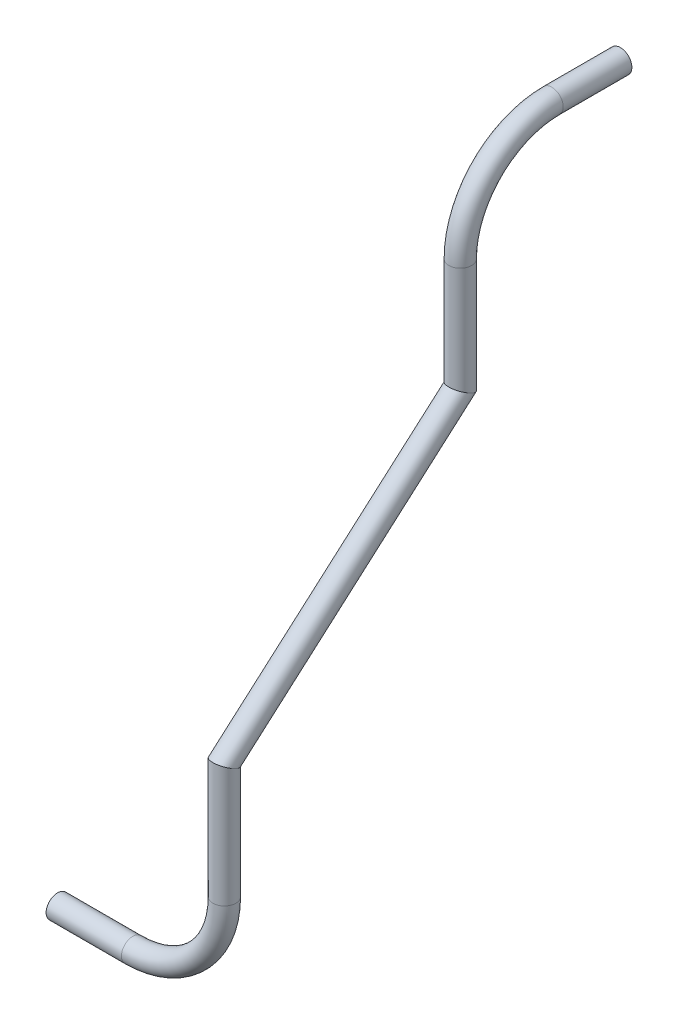
ISO-10303-21;
HEADER;
FILE_DESCRIPTION(('STEP AP214'),'2;1');
FILE_NAME('part.step','',(''),(''),'','','');
FILE_SCHEMA(('AUTOMOTIVE_DESIGN { 1 0 10303 214 1 1 1 1 }'));
ENDSEC;
DATA;
#1=APPLICATION_CONTEXT('core data for automotive mechanical design processes');
#2=APPLICATION_PROTOCOL_DEFINITION('international standard','automotive_design',2000,#1);
#3=PRODUCT_CONTEXT('',#1,'mechanical');
#4=PRODUCT('Part','Part','',(#3));
#5=PRODUCT_RELATED_PRODUCT_CATEGORY('part','',(#4));
#6=PRODUCT_DEFINITION_FORMATION('','',#4);
#7=PRODUCT_DEFINITION_CONTEXT('part definition',#1,'design');
#8=PRODUCT_DEFINITION('design','',#6,#7);
#9=PRODUCT_DEFINITION_SHAPE('','',#8);
#10=(LENGTH_UNIT() NAMED_UNIT(*) SI_UNIT(.MILLI.,.METRE.));
#11=(NAMED_UNIT(*) PLANE_ANGLE_UNIT() SI_UNIT($,.RADIAN.));
#12=(NAMED_UNIT(*) SI_UNIT($,.STERADIAN.) SOLID_ANGLE_UNIT());
#13=UNCERTAINTY_MEASURE_WITH_UNIT(LENGTH_MEASURE(1.E-05),#10,'distance_accuracy_value','');
#14=(GEOMETRIC_REPRESENTATION_CONTEXT(3) GLOBAL_UNCERTAINTY_ASSIGNED_CONTEXT((#13)) GLOBAL_UNIT_ASSIGNED_CONTEXT((#10,
#11,#12)) REPRESENTATION_CONTEXT('',''));
#15=CARTESIAN_POINT('',(0.,0.,0.));
#16=DIRECTION('',(0.,0.,1.));
#17=DIRECTION('',(1.,0.,0.));
#18=AXIS2_PLACEMENT_3D('',#15,#16,#17);
#19=CARTESIAN_POINT('',(-360.990564543855,1382.24393798514,528.675597350539));
#20=DIRECTION('',(-1.,0.,0.));
#21=DIRECTION('',(0.,0.,1.));
#22=AXIS2_PLACEMENT_3D('',#19,#20,#21);
#23=CYLINDRICAL_SURFACE('',#22,5.28320000000001);
#24=CARTESIAN_POINT('',(-402.785662914569,1382.24393798514,528.675597350539));
#25=DIRECTION('',(1.,0.,0.));
#26=DIRECTION('',(0.,0.,-1.));
#27=AXIS2_PLACEMENT_3D('',#24,#25,#26);
#28=CIRCLE('',#27,5.28320000000001);
#29=CARTESIAN_POINT('',(-402.785662914569,1382.24393798514,523.392397350539));
#30=VERTEX_POINT('',#29);
#31=EDGE_CURVE('E56',#30,#30,#28,.T.);
#32=ORIENTED_EDGE('',*,*,#31,.F.);
#33=EDGE_LOOP('',(#32));
#34=FACE_BOUND('',#33,.T.);
#35=CARTESIAN_POINT('',(-360.990564543855,1382.24393798514,528.675597350539));
#36=DIRECTION('',(1.,0.,0.));
#37=DIRECTION('',(0.,0.,-1.));
#38=AXIS2_PLACEMENT_3D('',#35,#36,#37);
#39=CIRCLE('',#38,5.28320000000001);
#40=CARTESIAN_POINT('',(-360.990564543855,1382.24393798514,523.392397350539));
#41=VERTEX_POINT('',#40);
#42=EDGE_CURVE('E52',#41,#41,#39,.T.);
#43=ORIENTED_EDGE('',*,*,#42,.T.);
#44=EDGE_LOOP('',(#43));
#45=FACE_BOUND('',#44,.T.);
#46=ADVANCED_FACE('F48',(#34,#45),#23,.F.);
#47=CARTESIAN_POINT('',(-360.990564543855,1382.24393798514,528.675597350539));
#48=DIRECTION('',(-1.,0.,0.));
#49=DIRECTION('',(0.,0.,1.));
#50=AXIS2_PLACEMENT_3D('',#47,#48,#49);
#51=CYLINDRICAL_SURFACE('',#50,6.35000000000005);
#52=CARTESIAN_POINT('',(-402.785662914569,1382.24393798514,528.675597350539));
#53=DIRECTION('',(1.,0.,0.));
#54=DIRECTION('',(0.,0.,-1.));
#55=AXIS2_PLACEMENT_3D('',#52,#53,#54);
#56=CIRCLE('',#55,6.35000000000005);
#57=CARTESIAN_POINT('',(-402.785662914569,1382.24393798514,522.325597350539));
#58=VERTEX_POINT('',#57);
#59=EDGE_CURVE('E60',#58,#58,#56,.T.);
#60=ORIENTED_EDGE('',*,*,#59,.T.);
#61=EDGE_LOOP('',(#60));
#62=FACE_BOUND('',#61,.T.);
#63=CARTESIAN_POINT('',(-360.990564543855,1382.24393798514,528.675597350539));
#64=DIRECTION('',(1.,0.,0.));
#65=DIRECTION('',(0.,0.,-1.));
#66=AXIS2_PLACEMENT_3D('',#63,#64,#65);
#67=CIRCLE('',#66,6.35000000000005);
#68=CARTESIAN_POINT('',(-360.990564543855,1382.24393798514,522.325597350539));
#69=VERTEX_POINT('',#68);
#70=EDGE_CURVE('E12',#69,#69,#67,.T.);
#71=ORIENTED_EDGE('',*,*,#70,.F.);
#72=EDGE_LOOP('',(#71));
#73=FACE_BOUND('',#72,.T.);
#74=ADVANCED_FACE('F75',(#62,#73),#51,.T.);
#75=CARTESIAN_POINT('',(-402.785662914569,1382.24393798514,528.675597350539));
#76=DIRECTION('',(1.,0.,0.));
#77=DIRECTION('',(0.,0.,-1.));
#78=AXIS2_PLACEMENT_3D('',#75,#76,#77);
#79=PLANE('',#78);
#80=ORIENTED_EDGE('',*,*,#31,.T.);
#81=EDGE_LOOP('',(#80));
#82=FACE_BOUND('',#81,.T.);
#83=ORIENTED_EDGE('',*,*,#59,.F.);
#84=EDGE_LOOP('',(#83));
#85=FACE_BOUND('',#84,.T.);
#86=ADVANCED_FACE('F71',(#82,#85),#79,.F.);
#87=CARTESIAN_POINT('',(-360.990564543855,1382.24393798514,528.675597350539));
#88=DIRECTION('',(1.,0.,0.));
#89=DIRECTION('',(0.,0.,-1.));
#90=AXIS2_PLACEMENT_3D('',#87,#88,#89);
#91=PLANE('',#90);
#92=ORIENTED_EDGE('',*,*,#42,.F.);
#93=EDGE_LOOP('',(#92));
#94=FACE_BOUND('',#93,.T.);
#95=ORIENTED_EDGE('',*,*,#70,.T.);
#96=EDGE_LOOP('',(#95));
#97=FACE_BOUND('',#96,.T.);
#98=ADVANCED_FACE('F50',(#94,#97),#91,.T.);
#99=CLOSED_SHELL('',(#46,#74,#86,#98));
#100=MANIFOLD_SOLID_BREP('B2',#99);
#101=CARTESIAN_POINT('',(-360.990564543855,1433.04393798514,528.675597350539));
#102=DIRECTION('',(0.,0.,-1.));
#103=DIRECTION('',(-1.,0.,0.));
#104=AXIS2_PLACEMENT_3D('',#101,#102,#103);
#105=TOROIDAL_SURFACE('',#104,50.8,5.28320000000001);
#106=CARTESIAN_POINT('',(-310.190564543855,1433.04393798514,528.675597350539));
#107=DIRECTION('',(0.,1.,0.));
#108=DIRECTION('',(-1.,0.,0.));
#109=AXIS2_PLACEMENT_3D('',#106,#107,#108);
#110=CIRCLE('',#109,5.28320000000001);
#111=CARTESIAN_POINT('',(-304.907364543855,1433.04393798514,528.675597350539));
#112=VERTEX_POINT('',#111);
#113=EDGE_CURVE('E152',#112,#112,#110,.T.);
#114=CARTESIAN_POINT('',(-360.990564543855,1382.24393798514,528.675597350539));
#115=DIRECTION('',(-1.,0.,0.));
#116=DIRECTION('',(0.,0.,1.));
#117=AXIS2_PLACEMENT_3D('',#114,#115,#116);
#118=CIRCLE('',#117,5.28320000000001);
#119=CARTESIAN_POINT('',(-360.990564543855,1376.96073798514,528.675597350539));
#120=VERTEX_POINT('',#119);
#121=EDGE_CURVE('E142',#120,#120,#118,.T.);
#122=CARTESIAN_POINT('',(-360.990564543855,1433.04393798514,528.675597350539));
#123=DIRECTION('',(0.,0.,-1.));
#124=DIRECTION('',(-1.,0.,0.));
#125=AXIS2_PLACEMENT_3D('',#122,#123,#124);
#126=CIRCLE('',#125,56.0832);
#127=EDGE_CURVE('',#112,#120,#126,.T.);
#128=ORIENTED_EDGE('',*,*,#113,.T.);
#129=ORIENTED_EDGE('',*,*,#121,.T.);
#130=ORIENTED_EDGE('',*,*,#127,.T.);
#131=ORIENTED_EDGE('',*,*,#127,.F.);
#132=EDGE_LOOP('',(#128,#130,#129,#131));
#133=FACE_BOUND('',#132,.T.);
#134=ADVANCED_FACE('F138',(#133),#105,.F.);
#135=CARTESIAN_POINT('',(-360.990564543855,1433.04393798514,528.675597350539));
#136=DIRECTION('',(0.,0.,-1.));
#137=DIRECTION('',(-1.,0.,0.));
#138=AXIS2_PLACEMENT_3D('',#135,#136,#137);
#139=TOROIDAL_SURFACE('',#138,50.8,6.35000000000005);
#140=CARTESIAN_POINT('',(-310.190564543855,1433.04393798514,528.675597350539));
#141=DIRECTION('',(0.,1.,0.));
#142=DIRECTION('',(-1.,0.,0.));
#143=AXIS2_PLACEMENT_3D('',#140,#141,#142);
#144=CIRCLE('',#143,6.35000000000005);
#145=CARTESIAN_POINT('',(-303.840564543855,1433.04393798514,528.675597350539));
#146=VERTEX_POINT('',#145);
#147=EDGE_CURVE('E146',#146,#146,#144,.T.);
#148=CARTESIAN_POINT('',(-360.990564543855,1382.24393798514,528.675597350539));
#149=DIRECTION('',(-1.,0.,0.));
#150=DIRECTION('',(0.,0.,1.));
#151=AXIS2_PLACEMENT_3D('',#148,#149,#150);
#152=CIRCLE('',#151,6.35000000000005);
#153=CARTESIAN_POINT('',(-360.990564543855,1375.89393798514,528.675597350539));
#154=VERTEX_POINT('',#153);
#155=EDGE_CURVE('E47',#154,#154,#152,.T.);
#156=CARTESIAN_POINT('',(-360.990564543855,1433.04393798514,528.675597350539));
#157=DIRECTION('',(0.,0.,-1.));
#158=DIRECTION('',(-1.,0.,0.));
#159=AXIS2_PLACEMENT_3D('',#156,#157,#158);
#160=CIRCLE('',#159,57.1500000000001);
#161=EDGE_CURVE('',#146,#154,#160,.T.);
#162=ORIENTED_EDGE('',*,*,#147,.F.);
#163=ORIENTED_EDGE('',*,*,#155,.F.);
#164=ORIENTED_EDGE('',*,*,#161,.T.);
#165=ORIENTED_EDGE('',*,*,#161,.F.);
#166=EDGE_LOOP('',(#162,#164,#163,#165));
#167=FACE_BOUND('',#166,.T.);
#168=ADVANCED_FACE('F165',(#167),#139,.T.);
#169=CARTESIAN_POINT('',(-310.190564543855,1433.04393798514,528.675597350539));
#170=DIRECTION('',(0.,1.,0.));
#171=DIRECTION('',(-1.,0.,0.));
#172=AXIS2_PLACEMENT_3D('',#169,#170,#171);
#173=PLANE('',#172);
#174=ORIENTED_EDGE('',*,*,#113,.F.);
#175=EDGE_LOOP('',(#174));
#176=FACE_BOUND('',#175,.T.);
#177=ORIENTED_EDGE('',*,*,#147,.T.);
#178=EDGE_LOOP('',(#177));
#179=FACE_BOUND('',#178,.T.);
#180=ADVANCED_FACE('F161',(#176,#179),#173,.T.);
#181=CARTESIAN_POINT('',(-360.990564543855,1382.24393798514,528.675597350539));
#182=DIRECTION('',(-1.,0.,0.));
#183=DIRECTION('',(0.,0.,1.));
#184=AXIS2_PLACEMENT_3D('',#181,#182,#183);
#185=PLANE('',#184);
#186=ORIENTED_EDGE('',*,*,#121,.F.);
#187=EDGE_LOOP('',(#186));
#188=FACE_BOUND('',#187,.T.);
#189=ORIENTED_EDGE('',*,*,#155,.T.);
#190=EDGE_LOOP('',(#189));
#191=FACE_BOUND('',#190,.T.);
#192=ADVANCED_FACE('F140',(#188,#191),#185,.T.);
#193=CLOSED_SHELL('',(#134,#168,#180,#192));
#194=MANIFOLD_SOLID_BREP('B7',#193);
#195=CARTESIAN_POINT('',(-310.190564543855,1497.77881638538,528.675597350539));
#196=DIRECTION('',(0.,-1.,0.));
#197=DIRECTION('',(0.,0.,-1.));
#198=AXIS2_PLACEMENT_3D('',#195,#196,#197);
#199=CYLINDRICAL_SURFACE('',#198,5.28320000000001);
#200=CARTESIAN_POINT('',(-310.190564543855,1497.77881638538,528.675597350539));
#201=DIRECTION('',(-3.30073379565397E-05,0.911047269287223,-0.412301918543693));
#202=DIRECTION('',(-7.29350111238835E-05,-0.412301919864914,-0.911047266367772));
#203=AXIS2_PLACEMENT_3D('',#200,#201,#202);
#204=ELLIPSE('',#203,5.79904048681627,5.28320000000001);
#205=CARTESIAN_POINT('',(-310.190987496937,1495.38786085929,523.392397367469));
#206=VERTEX_POINT('',#205);
#207=EDGE_CURVE('E246',#206,#206,#204,.T.);
#208=ORIENTED_EDGE('',*,*,#207,.T.);
#209=EDGE_LOOP('',(#208));
#210=FACE_BOUND('',#209,.T.);
#211=CARTESIAN_POINT('',(-310.190564543855,1433.04393798514,528.675597350539));
#212=DIRECTION('',(0.,-1.,0.));
#213=DIRECTION('',(1.,0.,0.));
#214=AXIS2_PLACEMENT_3D('',#211,#212,#213);
#215=CIRCLE('',#214,5.28320000000001);
#216=CARTESIAN_POINT('',(-304.907364543855,1433.04393798514,528.675597350539));
#217=VERTEX_POINT('',#216);
#218=EDGE_CURVE('E236',#217,#217,#215,.T.);
#219=ORIENTED_EDGE('',*,*,#218,.T.);
#220=EDGE_LOOP('',(#219));
#221=FACE_BOUND('',#220,.T.);
#222=ADVANCED_FACE('F232',(#210,#221),#199,.F.);
#223=CARTESIAN_POINT('',(-310.190564543855,1497.77881638538,528.675597350539));
#224=DIRECTION('',(0.,-1.,0.));
#225=DIRECTION('',(0.,0.,-1.));
#226=AXIS2_PLACEMENT_3D('',#223,#224,#225);
#227=CYLINDRICAL_SURFACE('',#226,6.35000000000005);
#228=CARTESIAN_POINT('',(-310.190564543855,1497.77881638538,528.675597350539));
#229=DIRECTION('',(-3.30073379565397E-05,0.911047269287223,-0.412301918543693));
#230=DIRECTION('',(-7.29350111238835E-05,-0.412301919864914,-0.911047266367772));
#231=AXIS2_PLACEMENT_3D('',#228,#229,#230);
#232=ELLIPSE('',#231,6.97000058511574,6.35000000000005);
#233=CARTESIAN_POINT('',(-310.191072900925,1494.90507176267,522.325597370887));
#234=VERTEX_POINT('',#233);
#235=EDGE_CURVE('E240',#234,#234,#232,.T.);
#236=ORIENTED_EDGE('',*,*,#235,.F.);
#237=EDGE_LOOP('',(#236));
#238=FACE_BOUND('',#237,.T.);
#239=CARTESIAN_POINT('',(-310.190564543855,1433.04393798514,528.675597350539));
#240=DIRECTION('',(0.,-1.,0.));
#241=DIRECTION('',(1.,0.,0.));
#242=AXIS2_PLACEMENT_3D('',#239,#240,#241);
#243=CIRCLE('',#242,6.35000000000005);
#244=CARTESIAN_POINT('',(-303.840564543855,1433.04393798514,528.675597350539));
#245=VERTEX_POINT('',#244);
#246=EDGE_CURVE('E137',#245,#245,#243,.T.);
#247=ORIENTED_EDGE('',*,*,#246,.F.);
#248=EDGE_LOOP('',(#247));
#249=FACE_BOUND('',#248,.T.);
#250=ADVANCED_FACE('F259',(#238,#249),#227,.T.);
#251=CARTESIAN_POINT('',(-310.190564543855,1497.77881638538,528.675597350539));
#252=DIRECTION('',(-3.30073379565397E-05,0.911047269287223,-0.412301918543693));
#253=DIRECTION('',(0.,0.412301918768291,0.911047269783509));
#254=AXIS2_PLACEMENT_3D('',#251,#252,#253);
#255=PLANE('',#254);
#256=ORIENTED_EDGE('',*,*,#207,.F.);
#257=EDGE_LOOP('',(#256));
#258=FACE_BOUND('',#257,.T.);
#259=ORIENTED_EDGE('',*,*,#235,.T.);
#260=EDGE_LOOP('',(#259));
#261=FACE_BOUND('',#260,.T.);
#262=ADVANCED_FACE('F255',(#258,#261),#255,.T.);
#263=CARTESIAN_POINT('',(-310.190564543855,1433.04393798514,528.675597350539));
#264=DIRECTION('',(0.,-1.,0.));
#265=DIRECTION('',(1.,0.,0.));
#266=AXIS2_PLACEMENT_3D('',#263,#264,#265);
#267=PLANE('',#266);
#268=ORIENTED_EDGE('',*,*,#218,.F.);
#269=EDGE_LOOP('',(#268));
#270=FACE_BOUND('',#269,.T.);
#271=ORIENTED_EDGE('',*,*,#246,.T.);
#272=EDGE_LOOP('',(#271));
#273=FACE_BOUND('',#272,.T.);
#274=ADVANCED_FACE('F234',(#270,#273),#267,.T.);
#275=CLOSED_SHELL('',(#222,#250,#262,#274));
#276=MANIFOLD_SOLID_BREP('B42',#275);
#277=CARTESIAN_POINT('',(-310.201049776566,1612.84560223325,397.702249283075));
#278=DIRECTION('',(6.01424902236145E-05,-0.660014253751412,0.751253074022228));
#279=DIRECTION('',(0.,-0.751253075380914,-0.660014254945087));
#280=AXIS2_PLACEMENT_3D('',#277,#278,#279);
#281=CYLINDRICAL_SURFACE('',#280,5.28320000000001);
#282=CARTESIAN_POINT('',(-310.201049776566,1612.84560223325,397.702249283075));
#283=DIRECTION('',(-3.30073379565397E-05,0.911047269287223,-0.412301918543692));
#284=DIRECTION('',(7.29350111241805E-05,0.412301919864913,0.911047266367772));
#285=AXIS2_PLACEMENT_3D('',#282,#283,#284);
#286=ELLIPSE('',#285,5.79904048681627,5.28320000000001);
#287=CARTESIAN_POINT('',(-310.200626823483,1615.23655775934,402.985449266145));
#288=VERTEX_POINT('',#287);
#289=EDGE_CURVE('E338',#288,#288,#286,.T.);
#290=ORIENTED_EDGE('',*,*,#289,.T.);
#291=EDGE_LOOP('',(#290));
#292=FACE_BOUND('',#291,.T.);
#293=CARTESIAN_POINT('',(-310.190564543855,1497.77881638538,528.675597350539));
#294=DIRECTION('',(3.30073379565398E-05,-0.911047269287223,0.412301918543693));
#295=DIRECTION('',(7.29350111241805E-05,0.412301919864914,0.911047266367772));
#296=AXIS2_PLACEMENT_3D('',#293,#294,#295);
#297=ELLIPSE('',#296,5.79904048681627,5.28320000000001);
#298=CARTESIAN_POINT('',(-310.190141590773,1500.16977191146,533.958797333609));
#299=VERTEX_POINT('',#298);
#300=EDGE_CURVE('E328',#299,#299,#297,.T.);
#301=ORIENTED_EDGE('',*,*,#300,.T.);
#302=EDGE_LOOP('',(#301));
#303=FACE_BOUND('',#302,.T.);
#304=ADVANCED_FACE('F324',(#292,#303),#281,.F.);
#305=CARTESIAN_POINT('',(-310.201049776566,1612.84560223325,397.702249283075));
#306=DIRECTION('',(6.01424902236145E-05,-0.660014253751412,0.751253074022228));
#307=DIRECTION('',(0.,-0.751253075380914,-0.660014254945087));
#308=AXIS2_PLACEMENT_3D('',#305,#306,#307);
#309=CYLINDRICAL_SURFACE('',#308,6.35000000000005);
#310=CARTESIAN_POINT('',(-310.201049776566,1612.84560223325,397.702249283075));
#311=DIRECTION('',(-3.30073379565397E-05,0.911047269287223,-0.412301918543692));
#312=DIRECTION('',(7.29350111241805E-05,0.412301919864913,0.911047266367772));
#313=AXIS2_PLACEMENT_3D('',#310,#311,#312);
#314=ELLIPSE('',#313,6.97000058511575,6.35000000000005);
#315=CARTESIAN_POINT('',(-310.200541419495,1615.71934685595,404.052249262726));
#316=VERTEX_POINT('',#315);
#317=EDGE_CURVE('E332',#316,#316,#314,.T.);
#318=ORIENTED_EDGE('',*,*,#317,.F.);
#319=EDGE_LOOP('',(#318));
#320=FACE_BOUND('',#319,.T.);
#321=CARTESIAN_POINT('',(-310.190564543855,1497.77881638538,528.675597350539));
#322=DIRECTION('',(3.30073379565398E-05,-0.911047269287223,0.412301918543693));
#323=DIRECTION('',(7.29350111241805E-05,0.412301919864914,0.911047266367772));
#324=AXIS2_PLACEMENT_3D('',#321,#322,#323);
#325=ELLIPSE('',#324,6.97000058511575,6.35000000000005);
#326=CARTESIAN_POINT('',(-310.190056186785,1500.65256100808,535.02559733019));
#327=VERTEX_POINT('',#326);
#328=EDGE_CURVE('E231',#327,#327,#325,.T.);
#329=ORIENTED_EDGE('',*,*,#328,.F.);
#330=EDGE_LOOP('',(#329));
#331=FACE_BOUND('',#330,.T.);
#332=ADVANCED_FACE('F351',(#320,#331),#309,.T.);
#333=CARTESIAN_POINT('',(-310.201049776565,1612.84560223325,397.702249283075));
#334=DIRECTION('',(-3.30073379565397E-05,0.911047269287223,-0.412301918543692));
#335=DIRECTION('',(0.,0.41230191876829,0.911047269783509));
#336=AXIS2_PLACEMENT_3D('',#333,#334,#335);
#337=PLANE('',#336);
#338=ORIENTED_EDGE('',*,*,#289,.F.);
#339=EDGE_LOOP('',(#338));
#340=FACE_BOUND('',#339,.T.);
#341=ORIENTED_EDGE('',*,*,#317,.T.);
#342=EDGE_LOOP('',(#341));
#343=FACE_BOUND('',#342,.T.);
#344=ADVANCED_FACE('F347',(#340,#343),#337,.T.);
#345=CARTESIAN_POINT('',(-310.190564543855,1497.77881638538,528.675597350539));
#346=DIRECTION('',(3.30073379565398E-05,-0.911047269287223,0.412301918543693));
#347=DIRECTION('',(0.,-0.412301918768291,-0.911047269783509));
#348=AXIS2_PLACEMENT_3D('',#345,#346,#347);
#349=PLANE('',#348);
#350=ORIENTED_EDGE('',*,*,#300,.F.);
#351=EDGE_LOOP('',(#350));
#352=FACE_BOUND('',#351,.T.);
#353=ORIENTED_EDGE('',*,*,#328,.T.);
#354=EDGE_LOOP('',(#353));
#355=FACE_BOUND('',#354,.T.);
#356=ADVANCED_FACE('F326',(#352,#355),#349,.T.);
#357=CLOSED_SHELL('',(#304,#332,#344,#356));
#358=MANIFOLD_SOLID_BREP('B132',#357);
#359=CARTESIAN_POINT('',(-310.201049776566,1674.15723382575,397.702249283075));
#360=DIRECTION('',(0.,-1.,0.));
#361=DIRECTION('',(0.,0.,-1.));
#362=AXIS2_PLACEMENT_3D('',#359,#360,#361);
#363=CYLINDRICAL_SURFACE('',#362,5.28320000000001);
#364=CARTESIAN_POINT('',(-310.201049776566,1674.15723382575,397.702249283075));
#365=DIRECTION('',(0.,1.,0.));
#366=DIRECTION('',(0.,0.,1.));
#367=AXIS2_PLACEMENT_3D('',#364,#365,#366);
#368=CIRCLE('',#367,5.28320000000001);
#369=CARTESIAN_POINT('',(-310.201049776566,1674.15723382575,402.985449283075));
#370=VERTEX_POINT('',#369);
#371=EDGE_CURVE('E430',#370,#370,#368,.T.);
#372=ORIENTED_EDGE('',*,*,#371,.T.);
#373=EDGE_LOOP('',(#372));
#374=FACE_BOUND('',#373,.T.);
#375=CARTESIAN_POINT('',(-310.201049776566,1612.84560223325,397.702249283075));
#376=DIRECTION('',(3.30073379565398E-05,-0.911047269287223,0.412301918543692));
#377=DIRECTION('',(-7.29350111238835E-05,-0.412301919864914,-0.911047266367772));
#378=AXIS2_PLACEMENT_3D('',#375,#376,#377);
#379=ELLIPSE('',#378,5.79904048681627,5.28320000000001);
#380=CARTESIAN_POINT('',(-310.201472729648,1610.45464670716,392.419049300005));
#381=VERTEX_POINT('',#380);
#382=EDGE_CURVE('E420',#381,#381,#379,.T.);
#383=ORIENTED_EDGE('',*,*,#382,.T.);
#384=EDGE_LOOP('',(#383));
#385=FACE_BOUND('',#384,.T.);
#386=ADVANCED_FACE('F416',(#374,#385),#363,.F.);
#387=CARTESIAN_POINT('',(-310.201049776566,1674.15723382575,397.702249283075));
#388=DIRECTION('',(0.,-1.,0.));
#389=DIRECTION('',(0.,0.,-1.));
#390=AXIS2_PLACEMENT_3D('',#387,#388,#389);
#391=CYLINDRICAL_SURFACE('',#390,6.35000000000005);
#392=CARTESIAN_POINT('',(-310.201049776566,1674.15723382575,397.702249283075));
#393=DIRECTION('',(0.,1.,0.));
#394=DIRECTION('',(0.,0.,1.));
#395=AXIS2_PLACEMENT_3D('',#392,#393,#394);
#396=CIRCLE('',#395,6.35000000000005);
#397=CARTESIAN_POINT('',(-310.201049776566,1674.15723382575,404.052249283075));
#398=VERTEX_POINT('',#397);
#399=EDGE_CURVE('E424',#398,#398,#396,.T.);
#400=ORIENTED_EDGE('',*,*,#399,.F.);
#401=EDGE_LOOP('',(#400));
#402=FACE_BOUND('',#401,.T.);
#403=CARTESIAN_POINT('',(-310.201049776566,1612.84560223325,397.702249283075));
#404=DIRECTION('',(3.30073379565398E-05,-0.911047269287223,0.412301918543692));
#405=DIRECTION('',(-7.29350111238835E-05,-0.412301919864914,-0.911047266367772));
#406=AXIS2_PLACEMENT_3D('',#403,#404,#405);
#407=ELLIPSE('',#406,6.97000058511575,6.35000000000005);
#408=CARTESIAN_POINT('',(-310.201558133636,1609.97185761054,391.352249303423));
#409=VERTEX_POINT('',#408);
#410=EDGE_CURVE('E323',#409,#409,#407,.T.);
#411=ORIENTED_EDGE('',*,*,#410,.F.);
#412=EDGE_LOOP('',(#411));
#413=FACE_BOUND('',#412,.T.);
#414=ADVANCED_FACE('F443',(#402,#413),#391,.T.);
#415=CARTESIAN_POINT('',(-310.201049776565,1674.15723382575,397.702249283075));
#416=DIRECTION('',(0.,1.,0.));
#417=DIRECTION('',(0.,0.,1.));
#418=AXIS2_PLACEMENT_3D('',#415,#416,#417);
#419=PLANE('',#418);
#420=ORIENTED_EDGE('',*,*,#371,.F.);
#421=EDGE_LOOP('',(#420));
#422=FACE_BOUND('',#421,.T.);
#423=ORIENTED_EDGE('',*,*,#399,.T.);
#424=EDGE_LOOP('',(#423));
#425=FACE_BOUND('',#424,.T.);
#426=ADVANCED_FACE('F439',(#422,#425),#419,.T.);
#427=CARTESIAN_POINT('',(-310.201049776565,1612.84560223325,397.702249283075));
#428=DIRECTION('',(3.30073379565398E-05,-0.911047269287223,0.412301918543692));
#429=DIRECTION('',(0.,-0.41230191876829,-0.911047269783509));
#430=AXIS2_PLACEMENT_3D('',#427,#428,#429);
#431=PLANE('',#430);
#432=ORIENTED_EDGE('',*,*,#382,.F.);
#433=EDGE_LOOP('',(#432));
#434=FACE_BOUND('',#433,.T.);
#435=ORIENTED_EDGE('',*,*,#410,.T.);
#436=EDGE_LOOP('',(#435));
#437=FACE_BOUND('',#436,.T.);
#438=ADVANCED_FACE('F418',(#434,#437),#431,.T.);
#439=CLOSED_SHELL('',(#386,#414,#426,#438));
#440=MANIFOLD_SOLID_BREP('B226',#439);
#441=CARTESIAN_POINT('',(-310.201049776566,1674.15723382575,346.902249283075));
#442=DIRECTION('',(1.,0.,0.));
#443=DIRECTION('',(0.,0.,-1.));
#444=AXIS2_PLACEMENT_3D('',#441,#442,#443);
#445=TOROIDAL_SURFACE('',#444,50.7999999999995,5.28320000000001);
#446=CARTESIAN_POINT('',(-310.201049776566,1724.95723382575,346.902249283075));
#447=DIRECTION('',(0.,0.,-1.));
#448=DIRECTION('',(0.,1.,0.));
#449=AXIS2_PLACEMENT_3D('',#446,#447,#448);
#450=CIRCLE('',#449,5.28320000000001);
#451=CARTESIAN_POINT('',(-310.201049776566,1730.24043382575,346.902249283075));
#452=VERTEX_POINT('',#451);
#453=EDGE_CURVE('E521',#452,#452,#450,.T.);
#454=CARTESIAN_POINT('',(-310.201049776566,1674.15723382575,397.702249283075));
#455=DIRECTION('',(0.,-1.,0.));
#456=DIRECTION('',(0.,0.,-1.));
#457=AXIS2_PLACEMENT_3D('',#454,#455,#456);
#458=CIRCLE('',#457,5.28320000000001);
#459=CARTESIAN_POINT('',(-310.201049776566,1674.15723382575,402.985449283075));
#460=VERTEX_POINT('',#459);
#461=EDGE_CURVE('E511',#460,#460,#458,.T.);
#462=CARTESIAN_POINT('',(-310.201049776566,1674.15723382575,346.902249283075));
#463=DIRECTION('',(1.,0.,0.));
#464=DIRECTION('',(0.,0.,-1.));
#465=AXIS2_PLACEMENT_3D('',#462,#463,#464);
#466=CIRCLE('',#465,56.0831999999995);
#467=EDGE_CURVE('',#452,#460,#466,.T.);
#468=ORIENTED_EDGE('',*,*,#453,.T.);
#469=ORIENTED_EDGE('',*,*,#461,.T.);
#470=ORIENTED_EDGE('',*,*,#467,.T.);
#471=ORIENTED_EDGE('',*,*,#467,.F.);
#472=EDGE_LOOP('',(#468,#470,#469,#471));
#473=FACE_BOUND('',#472,.T.);
#474=ADVANCED_FACE('F507',(#473),#445,.F.);
#475=CARTESIAN_POINT('',(-310.201049776566,1674.15723382575,346.902249283075));
#476=DIRECTION('',(1.,0.,0.));
#477=DIRECTION('',(0.,0.,-1.));
#478=AXIS2_PLACEMENT_3D('',#475,#476,#477);
#479=TOROIDAL_SURFACE('',#478,50.7999999999995,6.35000000000005);
#480=CARTESIAN_POINT('',(-310.201049776566,1724.95723382575,346.902249283075));
#481=DIRECTION('',(0.,0.,-1.));
#482=DIRECTION('',(0.,1.,0.));
#483=AXIS2_PLACEMENT_3D('',#480,#481,#482);
#484=CIRCLE('',#483,6.35000000000005);
#485=CARTESIAN_POINT('',(-310.201049776566,1731.30723382575,346.902249283075));
#486=VERTEX_POINT('',#485);
#487=EDGE_CURVE('E515',#486,#486,#484,.T.);
#488=CARTESIAN_POINT('',(-310.201049776566,1674.15723382575,397.702249283075));
#489=DIRECTION('',(0.,-1.,0.));
#490=DIRECTION('',(0.,0.,-1.));
#491=AXIS2_PLACEMENT_3D('',#488,#489,#490);
#492=CIRCLE('',#491,6.35000000000005);
#493=CARTESIAN_POINT('',(-310.201049776566,1674.15723382575,404.052249283075));
#494=VERTEX_POINT('',#493);
#495=EDGE_CURVE('E415',#494,#494,#492,.T.);
#496=CARTESIAN_POINT('',(-310.201049776566,1674.15723382575,346.902249283075));
#497=DIRECTION('',(1.,0.,0.));
#498=DIRECTION('',(0.,0.,-1.));
#499=AXIS2_PLACEMENT_3D('',#496,#497,#498);
#500=CIRCLE('',#499,57.1499999999996);
#501=EDGE_CURVE('',#486,#494,#500,.T.);
#502=ORIENTED_EDGE('',*,*,#487,.F.);
#503=ORIENTED_EDGE('',*,*,#495,.F.);
#504=ORIENTED_EDGE('',*,*,#501,.T.);
#505=ORIENTED_EDGE('',*,*,#501,.F.);
#506=EDGE_LOOP('',(#502,#504,#503,#505));
#507=FACE_BOUND('',#506,.T.);
#508=ADVANCED_FACE('F534',(#507),#479,.T.);
#509=CARTESIAN_POINT('',(-310.201049776565,1724.95723382575,346.902249283075));
#510=DIRECTION('',(0.,0.,-1.));
#511=DIRECTION('',(0.,1.,0.));
#512=AXIS2_PLACEMENT_3D('',#509,#510,#511);
#513=PLANE('',#512);
#514=ORIENTED_EDGE('',*,*,#453,.F.);
#515=EDGE_LOOP('',(#514));
#516=FACE_BOUND('',#515,.T.);
#517=ORIENTED_EDGE('',*,*,#487,.T.);
#518=EDGE_LOOP('',(#517));
#519=FACE_BOUND('',#518,.T.);
#520=ADVANCED_FACE('F530',(#516,#519),#513,.T.);
#521=CARTESIAN_POINT('',(-310.201049776565,1674.15723382575,397.702249283075));
#522=DIRECTION('',(0.,-1.,0.));
#523=DIRECTION('',(0.,0.,-1.));
#524=AXIS2_PLACEMENT_3D('',#521,#522,#523);
#525=PLANE('',#524);
#526=ORIENTED_EDGE('',*,*,#461,.F.);
#527=EDGE_LOOP('',(#526));
#528=FACE_BOUND('',#527,.T.);
#529=ORIENTED_EDGE('',*,*,#495,.T.);
#530=EDGE_LOOP('',(#529));
#531=FACE_BOUND('',#530,.T.);
#532=ADVANCED_FACE('F509',(#528,#531),#525,.T.);
#533=CLOSED_SHELL('',(#474,#508,#520,#532));
#534=MANIFOLD_SOLID_BREP('B318',#533);
#535=CARTESIAN_POINT('',(-310.201049776566,1724.95723382575,308.802249283075));
#536=DIRECTION('',(0.,0.,1.));
#537=DIRECTION('',(1.,0.,0.));
#538=AXIS2_PLACEMENT_3D('',#535,#536,#537);
#539=CYLINDRICAL_SURFACE('',#538,5.28320000000001);
#540=CARTESIAN_POINT('',(-310.201049776566,1724.95723382575,308.802249283075));
#541=DIRECTION('',(0.,0.,-1.));
#542=DIRECTION('',(0.,-1.,0.));
#543=AXIS2_PLACEMENT_3D('',#540,#541,#542);
#544=CIRCLE('',#543,5.28320000000001);
#545=CARTESIAN_POINT('',(-310.201049776566,1719.67403382575,308.802249283075));
#546=VERTEX_POINT('',#545);
#547=EDGE_CURVE('E607',#546,#546,#544,.T.);
#548=ORIENTED_EDGE('',*,*,#547,.T.);
#549=EDGE_LOOP('',(#548));
#550=FACE_BOUND('',#549,.T.);
#551=CARTESIAN_POINT('',(-310.201049776566,1724.95723382575,346.902249283075));
#552=DIRECTION('',(0.,0.,1.));
#553=DIRECTION('',(0.,-1.,0.));
#554=AXIS2_PLACEMENT_3D('',#551,#552,#553);
#555=CIRCLE('',#554,5.28320000000001);
#556=CARTESIAN_POINT('',(-310.201049776566,1719.67403382575,346.902249283075));
#557=VERTEX_POINT('',#556);
#558=EDGE_CURVE('E597',#557,#557,#555,.T.);
#559=ORIENTED_EDGE('',*,*,#558,.T.);
#560=EDGE_LOOP('',(#559));
#561=FACE_BOUND('',#560,.T.);
#562=ADVANCED_FACE('F593',(#550,#561),#539,.F.);
#563=CARTESIAN_POINT('',(-310.201049776566,1724.95723382575,308.802249283075));
#564=DIRECTION('',(0.,0.,1.));
#565=DIRECTION('',(1.,0.,0.));
#566=AXIS2_PLACEMENT_3D('',#563,#564,#565);
#567=CYLINDRICAL_SURFACE('',#566,6.35000000000005);
#568=CARTESIAN_POINT('',(-310.201049776566,1724.95723382575,308.802249283075));
#569=DIRECTION('',(0.,0.,-1.));
#570=DIRECTION('',(0.,-1.,0.));
#571=AXIS2_PLACEMENT_3D('',#568,#569,#570);
#572=CIRCLE('',#571,6.35000000000005);
#573=CARTESIAN_POINT('',(-310.201049776566,1718.60723382575,308.802249283075));
#574=VERTEX_POINT('',#573);
#575=EDGE_CURVE('E601',#574,#574,#572,.T.);
#576=ORIENTED_EDGE('',*,*,#575,.F.);
#577=EDGE_LOOP('',(#576));
#578=FACE_BOUND('',#577,.T.);
#579=CARTESIAN_POINT('',(-310.201049776566,1724.95723382575,346.902249283075));
#580=DIRECTION('',(0.,0.,1.));
#581=DIRECTION('',(0.,-1.,0.));
#582=AXIS2_PLACEMENT_3D('',#579,#580,#581);
#583=CIRCLE('',#582,6.35000000000005);
#584=CARTESIAN_POINT('',(-310.201049776566,1718.60723382575,346.902249283075));
#585=VERTEX_POINT('',#584);
#586=EDGE_CURVE('E506',#585,#585,#583,.T.);
#587=ORIENTED_EDGE('',*,*,#586,.F.);
#588=EDGE_LOOP('',(#587));
#589=FACE_BOUND('',#588,.T.);
#590=ADVANCED_FACE('F620',(#578,#589),#567,.T.);
#591=CARTESIAN_POINT('',(-310.201049776566,1724.95723382575,308.802249283075));
#592=DIRECTION('',(0.,0.,-1.));
#593=DIRECTION('',(0.,-1.,0.));
#594=AXIS2_PLACEMENT_3D('',#591,#592,#593);
#595=PLANE('',#594);
#596=ORIENTED_EDGE('',*,*,#547,.F.);
#597=EDGE_LOOP('',(#596));
#598=FACE_BOUND('',#597,.T.);
#599=ORIENTED_EDGE('',*,*,#575,.T.);
#600=EDGE_LOOP('',(#599));
#601=FACE_BOUND('',#600,.T.);
#602=ADVANCED_FACE('F616',(#598,#601),#595,.T.);
#603=CARTESIAN_POINT('',(-310.201049776565,1724.95723382575,346.902249283075));
#604=DIRECTION('',(0.,0.,1.));
#605=DIRECTION('',(0.,-1.,0.));
#606=AXIS2_PLACEMENT_3D('',#603,#604,#605);
#607=PLANE('',#606);
#608=ORIENTED_EDGE('',*,*,#558,.F.);
#609=EDGE_LOOP('',(#608));
#610=FACE_BOUND('',#609,.T.);
#611=ORIENTED_EDGE('',*,*,#586,.T.);
#612=EDGE_LOOP('',(#611));
#613=FACE_BOUND('',#612,.T.);
#614=ADVANCED_FACE('F595',(#610,#613),#607,.T.);
#615=CLOSED_SHELL('',(#562,#590,#602,#614));
#616=MANIFOLD_SOLID_BREP('B410',#615);
#617=ADVANCED_BREP_SHAPE_REPRESENTATION('',(#18,#100,#194,#276,#358,#440,#534,#616),#14);
#618=SHAPE_DEFINITION_REPRESENTATION(#9,#617);
ENDSEC;
END-ISO-10303-21;
